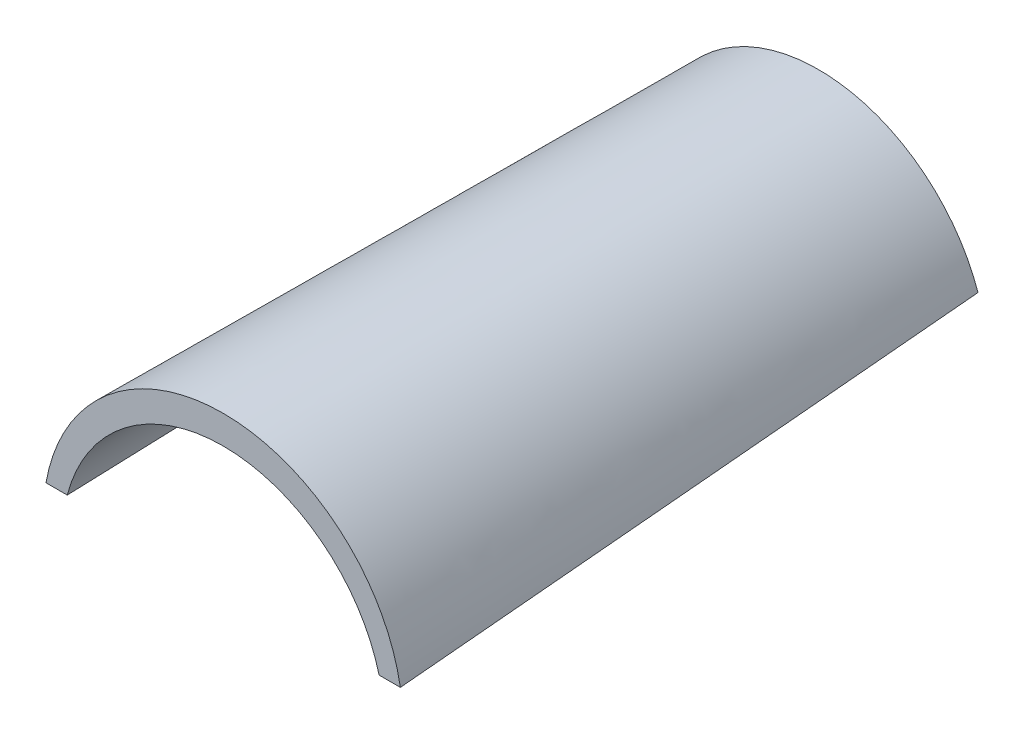
ISO-10303-21;
HEADER;
FILE_DESCRIPTION(('STEP AP214'),'2;1');
FILE_NAME('part.step','',(''),(''),'','','');
FILE_SCHEMA(('AUTOMOTIVE_DESIGN { 1 0 10303 214 1 1 1 1 }'));
ENDSEC;
DATA;
#1=APPLICATION_CONTEXT('core data for automotive mechanical design processes');
#2=APPLICATION_PROTOCOL_DEFINITION('international standard','automotive_design',2000,#1);
#3=PRODUCT_CONTEXT('',#1,'mechanical');
#4=PRODUCT('Part','Part','',(#3));
#5=PRODUCT_RELATED_PRODUCT_CATEGORY('part','',(#4));
#6=PRODUCT_DEFINITION_FORMATION('','',#4);
#7=PRODUCT_DEFINITION_CONTEXT('part definition',#1,'design');
#8=PRODUCT_DEFINITION('design','',#6,#7);
#9=PRODUCT_DEFINITION_SHAPE('','',#8);
#10=(LENGTH_UNIT() NAMED_UNIT(*) SI_UNIT(.MILLI.,.METRE.));
#11=(NAMED_UNIT(*) PLANE_ANGLE_UNIT() SI_UNIT($,.RADIAN.));
#12=(NAMED_UNIT(*) SI_UNIT($,.STERADIAN.) SOLID_ANGLE_UNIT());
#13=UNCERTAINTY_MEASURE_WITH_UNIT(LENGTH_MEASURE(1.E-05),#10,'distance_accuracy_value','');
#14=(GEOMETRIC_REPRESENTATION_CONTEXT(3) GLOBAL_UNCERTAINTY_ASSIGNED_CONTEXT((#13)) GLOBAL_UNIT_ASSIGNED_CONTEXT((#10,
#11,#12)) REPRESENTATION_CONTEXT('',''));
#15=CARTESIAN_POINT('',(0.,0.,0.));
#16=DIRECTION('',(0.,0.,1.));
#17=DIRECTION('',(1.,0.,0.));
#18=AXIS2_PLACEMENT_3D('',#15,#16,#17);
#19=CARTESIAN_POINT('',(125.,-14.1015625,-420.));
#20=DIRECTION('',(0.,0.,-1.));
#21=DIRECTION('',(-1.,0.,0.));
#22=AXIS2_PLACEMENT_3D('',#19,#20,#21);
#23=PLANE('',#22);
#24=CARTESIAN_POINT('',(125.,-14.1015625,-420.));
#25=DIRECTION('',(0.,0.,1.));
#26=DIRECTION('',(-1.,0.,0.));
#27=AXIS2_PLACEMENT_3D('',#24,#25,#26);
#28=CIRCLE('',#27,119.1015625);
#29=CARTESIAN_POINT('',(237.5,25.,-420.));
#30=VERTEX_POINT('',#29);
#31=CARTESIAN_POINT('',(12.5,25.,-420.));
#32=VERTEX_POINT('',#31);
#33=EDGE_CURVE('E234',#30,#32,#28,.T.);
#34=ORIENTED_EDGE('',*,*,#33,.F.);
#35=DIRECTION('',(1.,0.,0.));
#36=VECTOR('',#35,1.);
#37=CARTESIAN_POINT('',(225.205670850448,25.,-420.));
#38=LINE('',#37,#36);
#39=CARTESIAN_POINT('',(225.205670850448,25.,-420.));
#40=VERTEX_POINT('',#39);
#41=EDGE_CURVE('E188',#40,#30,#38,.T.);
#42=ORIENTED_EDGE('',*,*,#41,.F.);
#43=CARTESIAN_POINT('',(125.,-28.6764705882354,-420.));
#44=DIRECTION('',(0.,0.,-1.));
#45=DIRECTION('',(-1.,0.,0.));
#46=AXIS2_PLACEMENT_3D('',#43,#44,#45);
#47=CIRCLE('',#46,113.676470588235);
#48=CARTESIAN_POINT('',(24.7943291495524,25.,-420.));
#49=VERTEX_POINT('',#48);
#50=EDGE_CURVE('E168',#49,#40,#47,.T.);
#51=ORIENTED_EDGE('',*,*,#50,.F.);
#52=DIRECTION('',(1.,0.,0.));
#53=VECTOR('',#52,1.);
#54=CARTESIAN_POINT('',(12.5,25.,-420.));
#55=LINE('',#54,#53);
#56=EDGE_CURVE('E158',#32,#49,#55,.T.);
#57=ORIENTED_EDGE('',*,*,#56,.F.);
#58=EDGE_LOOP('',(#34,#42,#51,#57));
#59=FACE_BOUND('',#58,.T.);
#60=ADVANCED_FACE('F117',(#59),#23,.T.);
#61=CARTESIAN_POINT('',(125.,-21.9047619047619,0.));
#62=DIRECTION('',(0.,0.,-1.));
#63=DIRECTION('',(-1.,0.,0.));
#64=AXIS2_PLACEMENT_3D('',#61,#62,#63);
#65=PLANE('',#64);
#66=CARTESIAN_POINT('',(125.,-21.9047619047619,0.));
#67=DIRECTION('',(0.,0.,1.));
#68=DIRECTION('',(-1.,0.,0.));
#69=AXIS2_PLACEMENT_3D('',#66,#67,#68);
#70=CIRCLE('',#69,126.904761904762);
#71=CARTESIAN_POINT('',(250.,0.,0.));
#72=VERTEX_POINT('',#71);
#73=CARTESIAN_POINT('',(0.,0.,0.));
#74=VERTEX_POINT('',#73);
#75=EDGE_CURVE('E253',#72,#74,#70,.T.);
#76=ORIENTED_EDGE('',*,*,#75,.T.);
#77=DIRECTION('',(1.,0.,0.));
#78=VECTOR('',#77,1.);
#79=CARTESIAN_POINT('',(0.,0.,0.));
#80=LINE('',#79,#78);
#81=CARTESIAN_POINT('',(15.,0.,0.));
#82=VERTEX_POINT('',#81);
#83=EDGE_CURVE('E13',#74,#82,#80,.T.);
#84=ORIENTED_EDGE('',*,*,#83,.T.);
#85=CARTESIAN_POINT('',(125.,-28.6764705882353,0.));
#86=DIRECTION('',(0.,0.,-1.));
#87=DIRECTION('',(-1.,0.,0.));
#88=AXIS2_PLACEMENT_3D('',#85,#86,#87);
#89=CIRCLE('',#88,113.676470588235);
#90=CARTESIAN_POINT('',(235.,0.,0.));
#91=VERTEX_POINT('',#90);
#92=EDGE_CURVE('E130',#82,#91,#89,.T.);
#93=ORIENTED_EDGE('',*,*,#92,.T.);
#94=DIRECTION('',(1.,0.,0.));
#95=VECTOR('',#94,1.);
#96=CARTESIAN_POINT('',(235.,0.,0.));
#97=LINE('',#96,#95);
#98=EDGE_CURVE('E139',#91,#72,#97,.T.);
#99=ORIENTED_EDGE('',*,*,#98,.T.);
#100=EDGE_LOOP('',(#76,#84,#93,#99));
#101=FACE_BOUND('',#100,.T.);
#102=ADVANCED_FACE('F208',(#101),#65,.F.);
#103=CARTESIAN_POINT('',(0.,0.,0.));
#104=CARTESIAN_POINT('',(4.16666666666667,8.33333333333335,-140.));
#105=CARTESIAN_POINT('',(8.33333333333334,16.6666666666667,-280.));
#106=CARTESIAN_POINT('',(12.5,25.,-420.));
#107=CARTESIAN_POINT('',(1.27597649017184,7.28138757978494,0.));
#108=CARTESIAN_POINT('',(5.68838022833192,15.1183211868556,-140.));
#109=CARTESIAN_POINT('',(10.100783966492,22.9552547939263,-280.));
#110=CARTESIAN_POINT('',(14.5131877046521,30.792188400997,-420.));
#111=CARTESIAN_POINT('',(5.10295800468154,21.6186936988606,0.));
#112=CARTESIAN_POINT('',(9.88075219885029,28.4346164367662,-140.));
#113=CARTESIAN_POINT('',(14.658546393019,35.2505391746717,-280.));
#114=CARTESIAN_POINT('',(19.4363405871878,42.0664619125773,-420.000000000001));
#115=CARTESIAN_POINT('',(14.4929753340282,41.7951683590994,0.));
#116=CARTESIAN_POINT('',(19.4412739475917,47.077832032088,-140.));
#117=CARTESIAN_POINT('',(24.3895725611552,52.3604957050765,-279.999999999999));
#118=CARTESIAN_POINT('',(29.3378711747187,57.643159378065,-419.999999999999));
#119=CARTESIAN_POINT('',(27.2442780521413,60.0298580361602,0.));
#120=CARTESIAN_POINT('',(32.0030487445924,63.8574292751284,-140.));
#121=CARTESIAN_POINT('',(36.7618194370436,67.6850005140966,-280.000000000001));
#122=CARTESIAN_POINT('',(41.5205901294947,71.5125717530649,-420.000000000001));
#123=CARTESIAN_POINT('',(42.968602694692,75.7695413063442,0.));
#124=CARTESIAN_POINT('',(47.2106298235115,78.2939137335523,-140.));
#125=CARTESIAN_POINT('',(51.4526569523311,80.8182861607603,-279.999999999999));
#126=CARTESIAN_POINT('',(55.6946840811507,83.3426585879684,-419.999999999999));
#127=CARTESIAN_POINT('',(61.1873518830655,88.5369296006947,0.));
#128=CARTESIAN_POINT('',(64.6322168606324,89.9747469633477,-140.));
#129=CARTESIAN_POINT('',(68.0770818381994,91.4125643260007,-280.));
#130=CARTESIAN_POINT('',(71.5219468157663,92.8503816886538,-420.000000000001));
#131=CARTESIAN_POINT('',(81.346982239415,97.9443686226887,0.));
#132=CARTESIAN_POINT('',(83.772825520851,98.5656386814955,-140.));
#133=CARTESIAN_POINT('',(86.198668802287,99.1869087403023,-280.));
#134=CARTESIAN_POINT('',(88.624512083723,99.8081787991091,-420.));
#135=CARTESIAN_POINT('',(102.835240451257,103.706502126084,0.));
#136=CARTESIAN_POINT('',(104.088090652102,103.821056292922,-140.));
#137=CARTESIAN_POINT('',(105.340940852946,103.93561045976,-280.));
#138=CARTESIAN_POINT('',(106.593791053791,104.050164626598,-420.));
#139=CARTESIAN_POINT('',(117.611395165651,105.,0.));
#140=CARTESIAN_POINT('',(118.02920948481,105.,-140.));
#141=CARTESIAN_POINT('',(118.447023803969,105.,-280.));
#142=CARTESIAN_POINT('',(118.864838123127,105.,-420.));
#143=CARTESIAN_POINT('',(132.388604834349,105.,0.));
#144=CARTESIAN_POINT('',(131.97079051519,105.,-140.));
#145=CARTESIAN_POINT('',(131.552976196031,105.,-280.));
#146=CARTESIAN_POINT('',(131.135161876873,105.,-420.));
#147=CARTESIAN_POINT('',(147.164759548743,103.706502126084,0.));
#148=CARTESIAN_POINT('',(145.911909347899,103.821056292922,-140.));
#149=CARTESIAN_POINT('',(144.659059147054,103.935610459761,-280.));
#150=CARTESIAN_POINT('',(143.40620894621,104.050164626599,-420.));
#151=CARTESIAN_POINT('',(168.653017760585,97.9443686226884,0.));
#152=CARTESIAN_POINT('',(166.227174479149,98.5656386814952,-140.));
#153=CARTESIAN_POINT('',(163.801331197713,99.1869087403019,-280.000000000001));
#154=CARTESIAN_POINT('',(161.375487916276,99.8081787991087,-420.000000000001));
#155=CARTESIAN_POINT('',(188.812648116935,88.5369296006948,0.));
#156=CARTESIAN_POINT('',(185.367783139368,89.9747469633478,-139.999999999999));
#157=CARTESIAN_POINT('',(181.922918161801,91.4125643260008,-279.999999999999));
#158=CARTESIAN_POINT('',(178.478053184234,92.8503816886537,-419.999999999998));
#159=CARTESIAN_POINT('',(207.031397305308,75.7695413063442,0.));
#160=CARTESIAN_POINT('',(202.789370176488,78.2939137335523,-140.));
#161=CARTESIAN_POINT('',(198.547343047668,80.8182861607605,-280.));
#162=CARTESIAN_POINT('',(194.305315918849,83.3426585879686,-420.000000000001));
#163=CARTESIAN_POINT('',(222.755721947858,60.0298580361601,0.));
#164=CARTESIAN_POINT('',(217.996951255408,63.8574292751283,-140.));
#165=CARTESIAN_POINT('',(213.238180562957,67.6850005140965,-280.));
#166=CARTESIAN_POINT('',(208.479409870506,71.5125717530647,-420.));
#167=CARTESIAN_POINT('',(235.507024665972,41.7951683590996,0.));
#168=CARTESIAN_POINT('',(230.558726052408,47.0778320320881,-140.));
#169=CARTESIAN_POINT('',(225.610427438844,52.3604957050766,-280.));
#170=CARTESIAN_POINT('',(220.662128825281,57.643159378065,-420.000000000001));
#171=CARTESIAN_POINT('',(244.897041995319,21.6186936988605,0.));
#172=CARTESIAN_POINT('',(240.11924780115,28.4346164367661,-140.));
#173=CARTESIAN_POINT('',(235.341453606981,35.2505391746716,-280.));
#174=CARTESIAN_POINT('',(230.563659412813,42.0664619125772,-419.999999999999));
#175=CARTESIAN_POINT('',(248.724023509828,7.28138757978492,0.));
#176=CARTESIAN_POINT('',(244.311619771668,15.1183211868556,-140.));
#177=CARTESIAN_POINT('',(239.899216033508,22.9552547939263,-280.));
#178=CARTESIAN_POINT('',(235.486812295348,30.7921884009969,-420.));
#179=CARTESIAN_POINT('',(250.,0.,0.));
#180=CARTESIAN_POINT('',(245.833333333333,8.33333333333333,-140.));
#181=CARTESIAN_POINT('',(241.666666666667,16.6666666666667,-280.));
#182=CARTESIAN_POINT('',(237.5,25.,-420.));
#183=B_SPLINE_SURFACE_WITH_KNOTS('',3,3,((#103,#104,#105,#106),(#107,#108,#109,#110),(#111,#112,
#113,#114),(#115,#116,#117,#118),(#119,#120,#121,#122),(#123,#124,#125,#126),(#127,#128,#129,
#130),(#131,#132,#133,#134),(#135,#136,#137,#138),(#139,#140,#141,#142),(#143,#144,#145,#146),
(#147,#148,#149,#150),(#151,#152,#153,#154),(#155,#156,#157,#158),(#159,#160,#161,#162),(#163,
#164,#165,#166),(#167,#168,#169,#170),(#171,#172,#173,#174),(#175,#176,#177,#178),(#179,#180,
#181,#182)),.UNSPECIFIED.,.F.,.F.,.F.,(4,1,1,1,1,1,1,1,2,1,1,1,1,1,1,1,4),(4,4),
(0.479787082126811,0.512300389493885,0.544813696860959,0.577327004228034,0.609840311595108,
0.642353618962182,0.674866926329256,0.707380233696331,0.739893541063405,0.772406848430479,
0.804920155797554,0.837433463164628,0.869946770531703,0.902460077898777,0.934973385265851,
0.967486692632926,1.),(0.,1.),.UNSPECIFIED.);
#184=CARTESIAN_POINT('',(250.,0.,0.));
#185=CARTESIAN_POINT('',(245.833333333333,8.33333333333333,-140.));
#186=CARTESIAN_POINT('',(241.666666666667,16.6666666666667,-280.));
#187=CARTESIAN_POINT('',(237.5,25.,-420.));
#188=B_SPLINE_CURVE_WITH_KNOTS('',3,(#184,#185,#186,#187),.UNSPECIFIED.,.F.,.F.,(4,4),(0.,1.),.UNSPECIFIED.);
#189=EDGE_CURVE('E260',#72,#30,#188,.T.);
#190=CARTESIAN_POINT('',(0.,0.,0.));
#191=CARTESIAN_POINT('',(4.16666666666667,8.33333333333335,-140.));
#192=CARTESIAN_POINT('',(8.33333333333334,16.6666666666667,-280.));
#193=CARTESIAN_POINT('',(12.5,25.,-420.));
#194=B_SPLINE_CURVE_WITH_KNOTS('',3,(#190,#191,#192,#193),.UNSPECIFIED.,.F.,.F.,(4,4),(0.,1.),.UNSPECIFIED.);
#195=EDGE_CURVE('E175',#74,#32,#194,.T.);
#196=ORIENTED_EDGE('',*,*,#75,.F.);
#197=ORIENTED_EDGE('',*,*,#189,.T.);
#198=ORIENTED_EDGE('',*,*,#33,.T.);
#199=ORIENTED_EDGE('',*,*,#195,.F.);
#200=EDGE_LOOP('',(#196,#197,#198,#199));
#201=FACE_BOUND('',#200,.T.);
#202=ADVANCED_FACE('F209',(#201),#183,.T.);
#203=CARTESIAN_POINT('',(15.,0.,0.));
#204=DIRECTION('',(0.,-0.998233151734817,-0.0594186399842153));
#205=DIRECTION('',(-1.,0.,0.));
#206=AXIS2_PLACEMENT_3D('',#203,#204,#205);
#207=PLANE('',#206);
#208=ORIENTED_EDGE('',*,*,#83,.F.);
#209=ORIENTED_EDGE('',*,*,#195,.T.);
#210=ORIENTED_EDGE('',*,*,#56,.T.);
#211=CARTESIAN_POINT('',(15.,0.,0.));
#212=CARTESIAN_POINT('',(18.2647763831841,8.33333333333333,-140.));
#213=CARTESIAN_POINT('',(21.5295527663683,16.6666666666667,-280.));
#214=CARTESIAN_POINT('',(24.7943291495524,25.,-420.));
#215=B_SPLINE_CURVE_WITH_KNOTS('',3,(#211,#212,#213,#214),.UNSPECIFIED.,.F.,.F.,(4,4),(0.,1.),.UNSPECIFIED.);
#216=EDGE_CURVE('E165',#82,#49,#215,.T.);
#217=ORIENTED_EDGE('',*,*,#216,.F.);
#218=EDGE_LOOP('',(#208,#209,#210,#217));
#219=FACE_BOUND('',#218,.T.);
#220=ADVANCED_FACE('F180',(#219),#207,.T.);
#221=CARTESIAN_POINT('',(235.,0.,0.));
#222=CARTESIAN_POINT('',(231.735223616816,8.33333333333334,-140.));
#223=CARTESIAN_POINT('',(228.470447233632,16.6666666666667,-280.));
#224=CARTESIAN_POINT('',(225.205670850448,25.,-420.));
#225=CARTESIAN_POINT('',(233.427839742163,6.03064550185692,0.));
#226=CARTESIAN_POINT('',(229.882695105452,13.8554945471288,-140.));
#227=CARTESIAN_POINT('',(226.337550468742,21.6803435924008,-280.));
#228=CARTESIAN_POINT('',(222.792405832031,29.5051926376727,-420.));
#229=CARTESIAN_POINT('',(229.289635527956,17.8327483766922,0.));
#230=CARTESIAN_POINT('',(225.311873423906,24.6180422696934,-140.));
#231=CARTESIAN_POINT('',(221.334111319856,31.4033361626946,-280.));
#232=CARTESIAN_POINT('',(217.356349215806,38.1886300556958,-420.000000000001));
#233=CARTESIAN_POINT('',(220.267065557708,34.2805828488936,0.));
#234=CARTESIAN_POINT('',(216.020898104444,39.5214142129851,-140.));
#235=CARTESIAN_POINT('',(211.77473065118,44.7622455770766,-280.));
#236=CARTESIAN_POINT('',(207.528563197916,50.0030769411681,-420.));
#237=CARTESIAN_POINT('',(208.673447030752,49.0292157085168,0.));
#238=CARTESIAN_POINT('',(204.514300793425,52.813621317586,-140.));
#239=CARTESIAN_POINT('',(200.355154556097,56.5980269266553,-280.));
#240=CARTESIAN_POINT('',(196.19600831877,60.3824325357245,-420.));
#241=CARTESIAN_POINT('',(194.821346854656,61.680553268682,0.));
#242=CARTESIAN_POINT('',(191.073045285295,64.170895880548,-140.));
#243=CARTESIAN_POINT('',(187.324743715934,66.6612384924141,-280.));
#244=CARTESIAN_POINT('',(183.576442146573,69.1515811042801,-420.000000000001));
#245=CARTESIAN_POINT('',(179.084820183078,71.8931460405626,0.));
#246=CARTESIAN_POINT('',(176.019087538562,73.3072329976251,-140.));
#247=CARTESIAN_POINT('',(172.953354894046,74.7213199546875,-280.));
#248=CARTESIAN_POINT('',(169.887622249531,76.13540691175,-420.));
#249=CARTESIAN_POINT('',(161.888497840105,79.3913457831651,0.));
#250=CARTESIAN_POINT('',(159.721336974628,80.0022182398185,-140.));
#251=CARTESIAN_POINT('',(157.554176109151,80.6130906964719,-279.999999999999));
#252=CARTESIAN_POINT('',(155.387015243674,81.2239631531252,-419.999999999999));
#253=CARTESIAN_POINT('',(143.696564920163,83.9727778707772,0.));
#254=CARTESIAN_POINT('',(142.575072528453,84.0842862549837,-140.));
#255=CARTESIAN_POINT('',(141.453580136743,84.1957946391902,-280.));
#256=CARTESIAN_POINT('',(140.332087745033,84.3073030233968,-420.));
#257=CARTESIAN_POINT('',(125.,85.5137854098205,0.));
#258=CARTESIAN_POINT('',(125.,85.4584132284659,-140.));
#259=CARTESIAN_POINT('',(125.,85.4030410471113,-280.));
#260=CARTESIAN_POINT('',(125.,85.3476688657567,-420.000000000001));
#261=CARTESIAN_POINT('',(106.303435079837,83.9727778707767,0.));
#262=CARTESIAN_POINT('',(107.424927471547,84.0842862549834,-140.));
#263=CARTESIAN_POINT('',(108.546419863257,84.1957946391902,-280.));
#264=CARTESIAN_POINT('',(109.667912254967,84.3073030233969,-420.));
#265=CARTESIAN_POINT('',(88.1115021598952,79.3913457831657,0.));
#266=CARTESIAN_POINT('',(90.2786630253721,80.0022182398189,-140.));
#267=CARTESIAN_POINT('',(92.4458238908489,80.6130906964722,-280.));
#268=CARTESIAN_POINT('',(94.6129847563257,81.2239631531254,-420.));
#269=CARTESIAN_POINT('',(70.9151798169221,71.8931460405618,0.));
#270=CARTESIAN_POINT('',(73.9809124614377,73.3072329976246,-140.));
#271=CARTESIAN_POINT('',(77.0466451059533,74.7213199546873,-280.));
#272=CARTESIAN_POINT('',(80.1123777504688,76.1354069117501,-420.));
#273=CARTESIAN_POINT('',(55.1786531453436,61.6805532686824,0.));
#274=CARTESIAN_POINT('',(58.9269547147047,64.1708958805483,-140.));
#275=CARTESIAN_POINT('',(62.6752562840658,66.6612384924142,-280.));
#276=CARTESIAN_POINT('',(66.4235578534269,69.1515811042801,-420.));
#277=CARTESIAN_POINT('',(41.3265529692479,49.0292157085161,0.));
#278=CARTESIAN_POINT('',(45.4856992065754,52.8136213175856,-140.));
#279=CARTESIAN_POINT('',(49.644845443903,56.5980269266551,-280.));
#280=CARTESIAN_POINT('',(53.8039916812305,60.3824325357246,-420.));
#281=CARTESIAN_POINT('',(29.732934442292,34.2805828488939,0.));
#282=CARTESIAN_POINT('',(33.9791018955562,39.5214142129853,-140.));
#283=CARTESIAN_POINT('',(38.2252693488204,44.7622455770768,-280.));
#284=CARTESIAN_POINT('',(42.4714368020846,50.0030769411682,-420.));
#285=CARTESIAN_POINT('',(20.710364472044,17.832748376692,0.));
#286=CARTESIAN_POINT('',(24.688126576094,24.6180422696932,-140.));
#287=CARTESIAN_POINT('',(28.665888680144,31.4033361626944,-280.));
#288=CARTESIAN_POINT('',(32.643650784194,38.1886300556956,-420.));
#289=CARTESIAN_POINT('',(16.5721602578371,6.03064550185689,0.));
#290=CARTESIAN_POINT('',(20.1173048945478,13.8554945471288,-140.));
#291=CARTESIAN_POINT('',(23.6624495312585,21.6803435924008,-280.));
#292=CARTESIAN_POINT('',(27.2075941679692,29.5051926376727,-420.));
#293=CARTESIAN_POINT('',(15.,0.,0.));
#294=CARTESIAN_POINT('',(18.2647763831841,8.33333333333333,-140.));
#295=CARTESIAN_POINT('',(21.5295527663683,16.6666666666667,-280.));
#296=CARTESIAN_POINT('',(24.7943291495524,25.,-420.));
#297=B_SPLINE_SURFACE_WITH_KNOTS('',3,3,((#221,#222,#223,#224),(#225,#226,#227,#228),(#229,#230,
#231,#232),(#233,#234,#235,#236),(#237,#238,#239,#240),(#241,#242,#243,#244),(#245,#246,#247,
#248),(#249,#250,#251,#252),(#253,#254,#255,#256),(#257,#258,#259,#260),(#261,#262,#263,#264),
(#265,#266,#267,#268),(#269,#270,#271,#272),(#273,#274,#275,#276),(#277,#278,#279,#280),(#281,
#282,#283,#284),(#285,#286,#287,#288),(#289,#290,#291,#292),(#293,#294,#295,#296)),
.UNSPECIFIED.,.F.,.F.,.F.,(4,1,1,1,1,1,1,1,1,1,1,1,1,1,1,1,4),(4,4),(0.0218597108343147,
0.049113939612951,0.0763681683915873,0.103622397170224,0.13087662594886,0.158130854727496,
0.185385083506133,0.212639312284769,0.239893541063405,0.267147769842042,0.294401998620678,
0.321656227399314,0.34891045617795,0.376164684956587,0.403418913735223,0.430673142513859,
0.457927371292496),(0.,1.),.UNSPECIFIED.);
#298=CARTESIAN_POINT('',(235.,0.,0.));
#299=CARTESIAN_POINT('',(231.735223616816,8.33333333333334,-140.));
#300=CARTESIAN_POINT('',(228.470447233632,16.6666666666667,-280.));
#301=CARTESIAN_POINT('',(225.205670850448,25.,-420.));
#302=B_SPLINE_CURVE_WITH_KNOTS('',3,(#298,#299,#300,#301),.UNSPECIFIED.,.F.,.F.,(4,4),(0.,1.),.UNSPECIFIED.);
#303=EDGE_CURVE('E176',#91,#40,#302,.T.);
#304=ORIENTED_EDGE('',*,*,#92,.F.);
#305=ORIENTED_EDGE('',*,*,#216,.T.);
#306=ORIENTED_EDGE('',*,*,#50,.T.);
#307=ORIENTED_EDGE('',*,*,#303,.F.);
#308=EDGE_LOOP('',(#304,#305,#306,#307));
#309=FACE_BOUND('',#308,.T.);
#310=ADVANCED_FACE('F166',(#309),#297,.T.);
#311=CARTESIAN_POINT('',(250.,0.,0.));
#312=DIRECTION('',(0.,-0.998233151734817,-0.0594186399842152));
#313=DIRECTION('',(-1.,0.,0.));
#314=AXIS2_PLACEMENT_3D('',#311,#312,#313);
#315=PLANE('',#314);
#316=ORIENTED_EDGE('',*,*,#98,.F.);
#317=ORIENTED_EDGE('',*,*,#303,.T.);
#318=ORIENTED_EDGE('',*,*,#41,.T.);
#319=ORIENTED_EDGE('',*,*,#189,.F.);
#320=EDGE_LOOP('',(#316,#317,#318,#319));
#321=FACE_BOUND('',#320,.T.);
#322=ADVANCED_FACE('F119',(#321),#315,.T.);
#323=CLOSED_SHELL('',(#60,#102,#202,#220,#310,#322));
#324=MANIFOLD_SOLID_BREP('B2',#323);
#325=ADVANCED_BREP_SHAPE_REPRESENTATION('',(#18,#324),#14);
#326=SHAPE_DEFINITION_REPRESENTATION(#9,#325);
ENDSEC;
END-ISO-10303-21;
